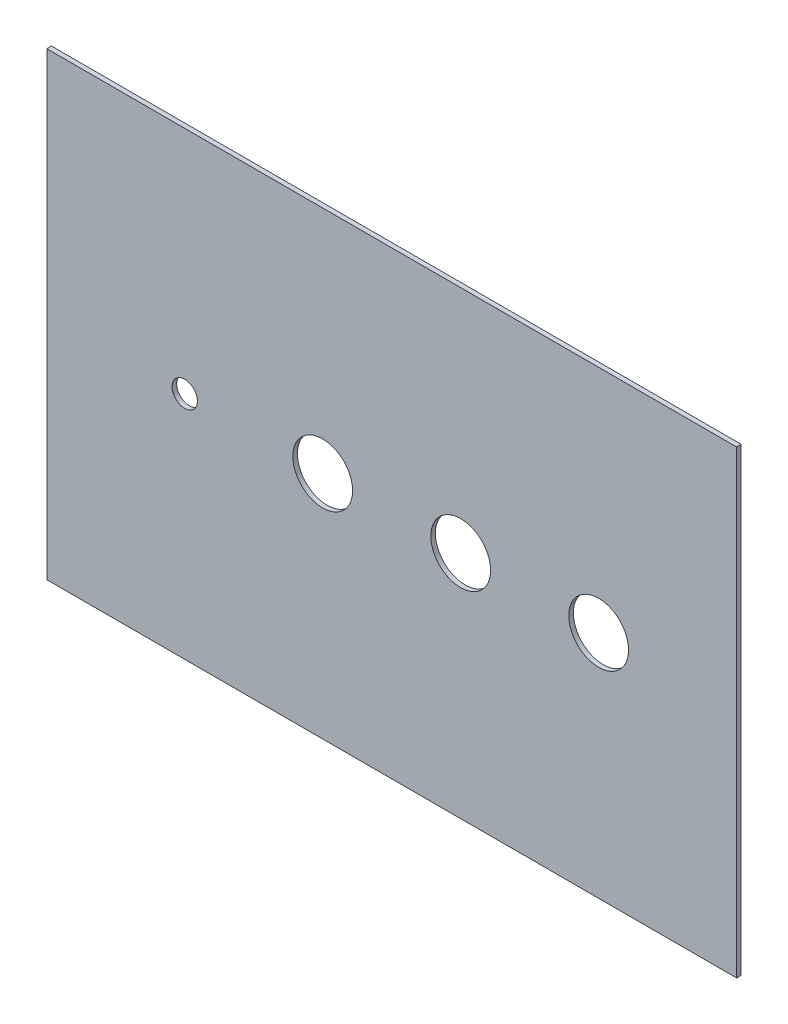
ISO-10303-21;
HEADER;
FILE_DESCRIPTION(('STEP AP214'),'2;1');
FILE_NAME('part.step','',(''),(''),'','','');
FILE_SCHEMA(('AUTOMOTIVE_DESIGN { 1 0 10303 214 1 1 1 1 }'));
ENDSEC;
DATA;
#1=APPLICATION_CONTEXT('core data for automotive mechanical design processes');
#2=APPLICATION_PROTOCOL_DEFINITION('international standard','automotive_design',2000,#1);
#3=PRODUCT_CONTEXT('',#1,'mechanical');
#4=PRODUCT('Part','Part','',(#3));
#5=PRODUCT_RELATED_PRODUCT_CATEGORY('part','',(#4));
#6=PRODUCT_DEFINITION_FORMATION('','',#4);
#7=PRODUCT_DEFINITION_CONTEXT('part definition',#1,'design');
#8=PRODUCT_DEFINITION('design','',#6,#7);
#9=PRODUCT_DEFINITION_SHAPE('','',#8);
#10=(LENGTH_UNIT() NAMED_UNIT(*) SI_UNIT(.MILLI.,.METRE.));
#11=(NAMED_UNIT(*) PLANE_ANGLE_UNIT() SI_UNIT($,.RADIAN.));
#12=(NAMED_UNIT(*) SI_UNIT($,.STERADIAN.) SOLID_ANGLE_UNIT());
#13=UNCERTAINTY_MEASURE_WITH_UNIT(LENGTH_MEASURE(1.E-05),#10,'distance_accuracy_value','');
#14=(GEOMETRIC_REPRESENTATION_CONTEXT(3) GLOBAL_UNCERTAINTY_ASSIGNED_CONTEXT((#13)) GLOBAL_UNIT_ASSIGNED_CONTEXT((#10,
#11,#12)) REPRESENTATION_CONTEXT('',''));
#15=CARTESIAN_POINT('',(0.,0.,0.));
#16=DIRECTION('',(0.,0.,1.));
#17=DIRECTION('',(1.,0.,0.));
#18=AXIS2_PLACEMENT_3D('',#15,#16,#17);
#19=CARTESIAN_POINT('',(0.,0.,0.));
#20=DIRECTION('',(0.,0.,-1.));
#21=DIRECTION('',(-1.,0.,0.));
#22=AXIS2_PLACEMENT_3D('',#19,#20,#21);
#23=PLANE('',#22);
#24=CARTESIAN_POINT('',(-90.0000000000001,0.,0.));
#25=DIRECTION('',(0.,0.,-1.));
#26=DIRECTION('',(-1.,0.,0.));
#27=AXIS2_PLACEMENT_3D('',#24,#25,#26);
#28=CIRCLE('',#27,5.50000000000013);
#29=CARTESIAN_POINT('',(-95.5000000000002,0.,0.));
#30=VERTEX_POINT('',#29);
#31=EDGE_CURVE('E89',#30,#30,#28,.F.);
#32=ORIENTED_EDGE('',*,*,#31,.T.);
#33=EDGE_LOOP('',(#32));
#34=FACE_BOUND('',#33,.T.);
#35=CARTESIAN_POINT('',(90.0000000000003,5.10702591327572E-12,0.));
#36=DIRECTION('',(0.,0.,-1.));
#37=DIRECTION('',(-1.,0.,0.));
#38=AXIS2_PLACEMENT_3D('',#35,#36,#37);
#39=CIRCLE('',#38,13.0000000000003);
#40=CARTESIAN_POINT('',(77.,5.10702591327572E-12,1.14741549595014E-13));
#41=VERTEX_POINT('',#40);
#42=EDGE_CURVE('E94',#41,#41,#39,.F.);
#43=ORIENTED_EDGE('',*,*,#42,.T.);
#44=EDGE_LOOP('',(#43));
#45=FACE_BOUND('',#44,.T.);
#46=DIRECTION('',(0.,1.,0.));
#47=VECTOR('',#46,1.);
#48=CARTESIAN_POINT('',(150.000000000003,100.000000000005,0.));
#49=LINE('',#48,#47);
#50=CARTESIAN_POINT('',(150.000000000003,100.000000000004,3.30985239216377E-13));
#51=VERTEX_POINT('',#50);
#52=CARTESIAN_POINT('',(150.000000000003,-99.999999999995,3.30985239216377E-13));
#53=VERTEX_POINT('',#52);
#54=EDGE_CURVE('E55',#51,#53,#49,.F.);
#55=ORIENTED_EDGE('',*,*,#54,.T.);
#56=DIRECTION('',(-1.,0.,0.));
#57=VECTOR('',#56,1.);
#58=CARTESIAN_POINT('',(150.000000000002,-99.999999999995,0.));
#59=LINE('',#58,#57);
#60=CARTESIAN_POINT('',(-150.000000000006,-99.9999999999962,-3.30985239216383E-13));
#61=VERTEX_POINT('',#60);
#62=EDGE_CURVE('E107',#53,#61,#59,.T.);
#63=ORIENTED_EDGE('',*,*,#62,.T.);
#64=DIRECTION('',(0.,1.,0.));
#65=VECTOR('',#64,1.);
#66=CARTESIAN_POINT('',(-150.000000000006,100.,0.));
#67=LINE('',#66,#65);
#68=CARTESIAN_POINT('',(-150.000000000006,100.000000000003,-3.30985239216383E-13));
#69=VERTEX_POINT('',#68);
#70=EDGE_CURVE('E60',#61,#69,#67,.T.);
#71=ORIENTED_EDGE('',*,*,#70,.T.);
#72=DIRECTION('',(1.,0.,0.));
#73=VECTOR('',#72,1.);
#74=CARTESIAN_POINT('',(150.000000000003,100.000000000005,0.));
#75=LINE('',#74,#73);
#76=EDGE_CURVE('E58',#69,#51,#75,.T.);
#77=ORIENTED_EDGE('',*,*,#76,.T.);
#78=EDGE_LOOP('',(#55,#63,#71,#77));
#79=FACE_BOUND('',#78,.T.);
#80=CARTESIAN_POINT('',(29.9999999999987,5.10702591327572E-12,0.));
#81=DIRECTION('',(0.,0.,-1.));
#82=DIRECTION('',(-1.,0.,0.));
#83=AXIS2_PLACEMENT_3D('',#80,#81,#82);
#84=CIRCLE('',#83,13.0000000000003);
#85=CARTESIAN_POINT('',(16.9999999999984,5.10702591327572E-12,1.14741549595014E-13));
#86=VERTEX_POINT('',#85);
#87=EDGE_CURVE('E19',#86,#86,#84,.F.);
#88=ORIENTED_EDGE('',*,*,#87,.T.);
#89=EDGE_LOOP('',(#88));
#90=FACE_BOUND('',#89,.T.);
#91=CARTESIAN_POINT('',(-30.,0.,0.));
#92=DIRECTION('',(0.,0.,-1.));
#93=DIRECTION('',(-1.,0.,0.));
#94=AXIS2_PLACEMENT_3D('',#91,#92,#93);
#95=CIRCLE('',#94,13.0000000000003);
#96=CARTESIAN_POINT('',(-43.0000000000003,0.,1.14741549595014E-13));
#97=VERTEX_POINT('',#96);
#98=EDGE_CURVE('E92',#97,#97,#95,.F.);
#99=ORIENTED_EDGE('',*,*,#98,.T.);
#100=EDGE_LOOP('',(#99));
#101=FACE_BOUND('',#100,.T.);
#102=ADVANCED_FACE('F16',(#34,#45,#79,#90,#101),#23,.T.);
#103=CARTESIAN_POINT('',(150.000000000003,100.000000000005,2.));
#104=DIRECTION('',(0.,-1.,0.));
#105=DIRECTION('',(1.,0.,0.));
#106=AXIS2_PLACEMENT_3D('',#103,#104,#105);
#107=PLANE('',#106);
#108=DIRECTION('',(0.,0.,-1.));
#109=VECTOR('',#108,1.);
#110=CARTESIAN_POINT('',(-150.000000000006,100.,2.));
#111=LINE('',#110,#109);
#112=CARTESIAN_POINT('',(-150.000000000006,100.000000000003,1.99999999999967));
#113=VERTEX_POINT('',#112);
#114=EDGE_CURVE('E101',#69,#113,#111,.F.);
#115=ORIENTED_EDGE('',*,*,#114,.T.);
#116=DIRECTION('',(-1.,0.,0.));
#117=VECTOR('',#116,1.);
#118=CARTESIAN_POINT('',(0.,100.,2.));
#119=LINE('',#118,#117);
#120=CARTESIAN_POINT('',(150.000000000003,100.000000000004,2.00000000000033));
#121=VERTEX_POINT('',#120);
#122=EDGE_CURVE('E76',#113,#121,#119,.F.);
#123=ORIENTED_EDGE('',*,*,#122,.T.);
#124=DIRECTION('',(0.,0.,1.));
#125=VECTOR('',#124,1.);
#126=CARTESIAN_POINT('',(150.000000000003,100.000000000005,2.));
#127=LINE('',#126,#125);
#128=EDGE_CURVE('E65',#121,#51,#127,.F.);
#129=ORIENTED_EDGE('',*,*,#128,.T.);
#130=ORIENTED_EDGE('',*,*,#76,.F.);
#131=EDGE_LOOP('',(#115,#123,#129,#130));
#132=FACE_BOUND('',#131,.T.);
#133=ADVANCED_FACE('F75',(#132),#107,.F.);
#134=CARTESIAN_POINT('',(150.000000000003,100.000000000005,2.));
#135=DIRECTION('',(-1.,0.,0.));
#136=DIRECTION('',(0.,0.,1.));
#137=AXIS2_PLACEMENT_3D('',#134,#135,#136);
#138=PLANE('',#137);
#139=ORIENTED_EDGE('',*,*,#128,.F.);
#140=DIRECTION('',(0.,1.,0.));
#141=VECTOR('',#140,1.);
#142=CARTESIAN_POINT('',(150.000000000003,0.,2.00000000000133));
#143=LINE('',#142,#141);
#144=CARTESIAN_POINT('',(150.000000000003,-99.999999999995,2.00000000000033));
#145=VERTEX_POINT('',#144);
#146=EDGE_CURVE('E115',#121,#145,#143,.F.);
#147=ORIENTED_EDGE('',*,*,#146,.T.);
#148=DIRECTION('',(0.,0.,1.));
#149=VECTOR('',#148,1.);
#150=CARTESIAN_POINT('',(150.000000000002,-99.999999999995,2.));
#151=LINE('',#150,#149);
#152=EDGE_CURVE('E72',#145,#53,#151,.F.);
#153=ORIENTED_EDGE('',*,*,#152,.T.);
#154=ORIENTED_EDGE('',*,*,#54,.F.);
#155=EDGE_LOOP('',(#139,#147,#153,#154));
#156=FACE_BOUND('',#155,.T.);
#157=ADVANCED_FACE('F69',(#156),#138,.F.);
#158=CARTESIAN_POINT('',(150.000000000002,-99.999999999995,2.));
#159=DIRECTION('',(0.,1.,0.));
#160=DIRECTION('',(-1.,0.,0.));
#161=AXIS2_PLACEMENT_3D('',#158,#159,#160);
#162=PLANE('',#161);
#163=ORIENTED_EDGE('',*,*,#152,.F.);
#164=DIRECTION('',(-1.,0.,0.));
#165=VECTOR('',#164,1.);
#166=CARTESIAN_POINT('',(0.,-99.999999999995,2.));
#167=LINE('',#166,#165);
#168=CARTESIAN_POINT('',(-150.000000000006,-99.9999999999962,1.99999999999967));
#169=VERTEX_POINT('',#168);
#170=EDGE_CURVE('E113',#145,#169,#167,.T.);
#171=ORIENTED_EDGE('',*,*,#170,.T.);
#172=DIRECTION('',(0.,0.,-1.));
#173=VECTOR('',#172,1.);
#174=CARTESIAN_POINT('',(-150.000000000006,-99.9999999999999,2.));
#175=LINE('',#174,#173);
#176=EDGE_CURVE('E34',#169,#61,#175,.T.);
#177=ORIENTED_EDGE('',*,*,#176,.T.);
#178=ORIENTED_EDGE('',*,*,#62,.F.);
#179=EDGE_LOOP('',(#163,#171,#177,#178));
#180=FACE_BOUND('',#179,.T.);
#181=ADVANCED_FACE('F111',(#180),#162,.F.);
#182=CARTESIAN_POINT('',(-150.000000000006,100.,2.));
#183=DIRECTION('',(1.,0.,0.));
#184=DIRECTION('',(0.,0.,-1.));
#185=AXIS2_PLACEMENT_3D('',#182,#183,#184);
#186=PLANE('',#185);
#187=ORIENTED_EDGE('',*,*,#176,.F.);
#188=DIRECTION('',(0.,1.,0.));
#189=VECTOR('',#188,1.);
#190=CARTESIAN_POINT('',(-150.000000000006,0.,1.99999999999868));
#191=LINE('',#190,#189);
#192=EDGE_CURVE('E88',#169,#113,#191,.T.);
#193=ORIENTED_EDGE('',*,*,#192,.T.);
#194=ORIENTED_EDGE('',*,*,#114,.F.);
#195=ORIENTED_EDGE('',*,*,#70,.F.);
#196=EDGE_LOOP('',(#187,#193,#194,#195));
#197=FACE_BOUND('',#196,.T.);
#198=ADVANCED_FACE('F109',(#197),#186,.F.);
#199=CARTESIAN_POINT('',(29.9999999999987,5.10702591327572E-12,2.));
#200=DIRECTION('',(0.,0.,-1.));
#201=DIRECTION('',(-1.,0.,0.));
#202=AXIS2_PLACEMENT_3D('',#199,#200,#201);
#203=CYLINDRICAL_SURFACE('',#202,13.0000000000003);
#204=ORIENTED_EDGE('',*,*,#87,.F.);
#205=EDGE_LOOP('',(#204));
#206=FACE_BOUND('',#205,.T.);
#207=CARTESIAN_POINT('',(29.9999999999987,5.10702591327572E-12,2.));
#208=DIRECTION('',(0.,0.,-1.));
#209=DIRECTION('',(-1.,0.,0.));
#210=AXIS2_PLACEMENT_3D('',#207,#208,#209);
#211=CIRCLE('',#210,13.0000000000003);
#212=CARTESIAN_POINT('',(16.9999999999984,5.10702591327572E-12,2.00000000000012));
#213=VERTEX_POINT('',#212);
#214=EDGE_CURVE('E85',#213,#213,#211,.F.);
#215=ORIENTED_EDGE('',*,*,#214,.T.);
#216=EDGE_LOOP('',(#215));
#217=FACE_BOUND('',#216,.T.);
#218=ADVANCED_FACE('F139',(#206,#217),#203,.F.);
#219=CARTESIAN_POINT('',(90.0000000000004,5.10702591327572E-12,2.));
#220=DIRECTION('',(0.,0.,-1.));
#221=DIRECTION('',(-1.,0.,0.));
#222=AXIS2_PLACEMENT_3D('',#219,#220,#221);
#223=CYLINDRICAL_SURFACE('',#222,13.0000000000003);
#224=ORIENTED_EDGE('',*,*,#42,.F.);
#225=EDGE_LOOP('',(#224));
#226=FACE_BOUND('',#225,.T.);
#227=CARTESIAN_POINT('',(90.0000000000004,5.10702591327572E-12,2.));
#228=DIRECTION('',(0.,0.,-1.));
#229=DIRECTION('',(-1.,0.,0.));
#230=AXIS2_PLACEMENT_3D('',#227,#228,#229);
#231=CIRCLE('',#230,13.0000000000003);
#232=CARTESIAN_POINT('',(77.0000000000001,5.10702591327572E-12,2.00000000000012));
#233=VERTEX_POINT('',#232);
#234=EDGE_CURVE('E82',#233,#233,#231,.F.);
#235=ORIENTED_EDGE('',*,*,#234,.T.);
#236=EDGE_LOOP('',(#235));
#237=FACE_BOUND('',#236,.T.);
#238=ADVANCED_FACE('F135',(#226,#237),#223,.F.);
#239=CARTESIAN_POINT('',(-30.,0.,2.));
#240=DIRECTION('',(0.,0.,-1.));
#241=DIRECTION('',(-1.,0.,0.));
#242=AXIS2_PLACEMENT_3D('',#239,#240,#241);
#243=CYLINDRICAL_SURFACE('',#242,13.0000000000003);
#244=ORIENTED_EDGE('',*,*,#98,.F.);
#245=EDGE_LOOP('',(#244));
#246=FACE_BOUND('',#245,.T.);
#247=CARTESIAN_POINT('',(-30.,0.,2.));
#248=DIRECTION('',(0.,0.,-1.));
#249=DIRECTION('',(-1.,0.,0.));
#250=AXIS2_PLACEMENT_3D('',#247,#248,#249);
#251=CIRCLE('',#250,13.0000000000003);
#252=CARTESIAN_POINT('',(-43.0000000000003,0.,2.00000000000012));
#253=VERTEX_POINT('',#252);
#254=EDGE_CURVE('E25',#253,#253,#251,.F.);
#255=ORIENTED_EDGE('',*,*,#254,.T.);
#256=EDGE_LOOP('',(#255));
#257=FACE_BOUND('',#256,.T.);
#258=ADVANCED_FACE('F127',(#246,#257),#243,.F.);
#259=CARTESIAN_POINT('',(-90.0000000000001,0.,2.));
#260=DIRECTION('',(0.,0.,-1.));
#261=DIRECTION('',(-1.,0.,0.));
#262=AXIS2_PLACEMENT_3D('',#259,#260,#261);
#263=CYLINDRICAL_SURFACE('',#262,5.50000000000013);
#264=ORIENTED_EDGE('',*,*,#31,.F.);
#265=EDGE_LOOP('',(#264));
#266=FACE_BOUND('',#265,.T.);
#267=CARTESIAN_POINT('',(-90.0000000000001,0.,2.));
#268=DIRECTION('',(0.,0.,-1.));
#269=DIRECTION('',(-1.,0.,0.));
#270=AXIS2_PLACEMENT_3D('',#267,#268,#269);
#271=CIRCLE('',#270,5.50000000000013);
#272=CARTESIAN_POINT('',(-95.5000000000002,0.,2.00000000000005));
#273=VERTEX_POINT('',#272);
#274=EDGE_CURVE('E11',#273,#273,#271,.F.);
#275=ORIENTED_EDGE('',*,*,#274,.T.);
#276=EDGE_LOOP('',(#275));
#277=FACE_BOUND('',#276,.T.);
#278=ADVANCED_FACE('F120',(#266,#277),#263,.F.);
#279=CARTESIAN_POINT('',(0.,0.,2.));
#280=DIRECTION('',(0.,0.,-1.));
#281=DIRECTION('',(-1.,0.,0.));
#282=AXIS2_PLACEMENT_3D('',#279,#280,#281);
#283=PLANE('',#282);
#284=ORIENTED_EDGE('',*,*,#274,.F.);
#285=EDGE_LOOP('',(#284));
#286=FACE_BOUND('',#285,.T.);
#287=ORIENTED_EDGE('',*,*,#254,.F.);
#288=EDGE_LOOP('',(#287));
#289=FACE_BOUND('',#288,.T.);
#290=ORIENTED_EDGE('',*,*,#234,.F.);
#291=EDGE_LOOP('',(#290));
#292=FACE_BOUND('',#291,.T.);
#293=ORIENTED_EDGE('',*,*,#214,.F.);
#294=EDGE_LOOP('',(#293));
#295=FACE_BOUND('',#294,.T.);
#296=ORIENTED_EDGE('',*,*,#170,.F.);
#297=ORIENTED_EDGE('',*,*,#146,.F.);
#298=ORIENTED_EDGE('',*,*,#122,.F.);
#299=ORIENTED_EDGE('',*,*,#192,.F.);
#300=EDGE_LOOP('',(#296,#297,#298,#299));
#301=FACE_BOUND('',#300,.T.);
#302=ADVANCED_FACE('F118',(#286,#289,#292,#295,#301),#283,.F.);
#303=CLOSED_SHELL('',(#102,#133,#157,#181,#198,#218,#238,#258,#278,#302));
#304=MANIFOLD_SOLID_BREP('B1',#303);
#305=ADVANCED_BREP_SHAPE_REPRESENTATION('',(#18,#304),#14);
#306=SHAPE_DEFINITION_REPRESENTATION(#9,#305);
ENDSEC;
END-ISO-10303-21;
